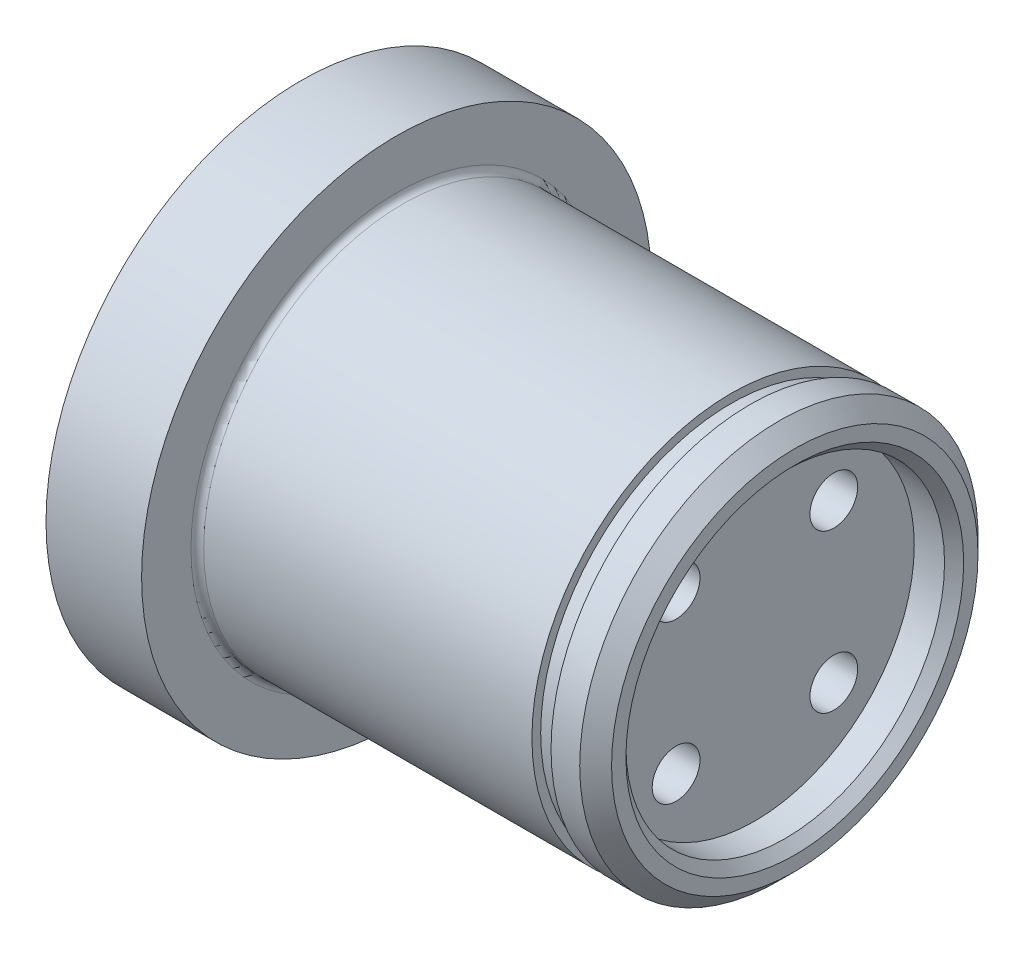
ISO-10303-21;
HEADER;
FILE_DESCRIPTION(('STEP AP214'),'2;1');
FILE_NAME('part.step','',(''),(''),'','','');
FILE_SCHEMA(('AUTOMOTIVE_DESIGN { 1 0 10303 214 1 1 1 1 }'));
ENDSEC;
DATA;
#1=APPLICATION_CONTEXT('core data for automotive mechanical design processes');
#2=APPLICATION_PROTOCOL_DEFINITION('international standard','automotive_design',2000,#1);
#3=PRODUCT_CONTEXT('',#1,'mechanical');
#4=PRODUCT('Part','Part','',(#3));
#5=PRODUCT_RELATED_PRODUCT_CATEGORY('part','',(#4));
#6=PRODUCT_DEFINITION_FORMATION('','',#4);
#7=PRODUCT_DEFINITION_CONTEXT('part definition',#1,'design');
#8=PRODUCT_DEFINITION('design','',#6,#7);
#9=PRODUCT_DEFINITION_SHAPE('','',#8);
#10=(LENGTH_UNIT() NAMED_UNIT(*) SI_UNIT(.MILLI.,.METRE.));
#11=(NAMED_UNIT(*) PLANE_ANGLE_UNIT() SI_UNIT($,.RADIAN.));
#12=(NAMED_UNIT(*) SI_UNIT($,.STERADIAN.) SOLID_ANGLE_UNIT());
#13=UNCERTAINTY_MEASURE_WITH_UNIT(LENGTH_MEASURE(1.E-05),#10,'distance_accuracy_value','');
#14=(GEOMETRIC_REPRESENTATION_CONTEXT(3) GLOBAL_UNCERTAINTY_ASSIGNED_CONTEXT((#13)) GLOBAL_UNIT_ASSIGNED_CONTEXT((#10,
#11,#12)) REPRESENTATION_CONTEXT('',''));
#15=CARTESIAN_POINT('',(0.,0.,0.));
#16=DIRECTION('',(0.,0.,1.));
#17=DIRECTION('',(1.,0.,0.));
#18=AXIS2_PLACEMENT_3D('',#15,#16,#17);
#19=CARTESIAN_POINT('',(0.,0.,0.));
#20=DIRECTION('',(-1.,0.,0.));
#21=DIRECTION('',(0.,0.,1.));
#22=AXIS2_PLACEMENT_3D('',#19,#20,#21);
#23=CYLINDRICAL_SURFACE('',#22,12.5);
#24=CARTESIAN_POINT('',(-24.6,0.,0.));
#25=DIRECTION('',(-1.,0.,0.));
#26=DIRECTION('',(0.,0.,1.));
#27=AXIS2_PLACEMENT_3D('',#24,#25,#26);
#28=CIRCLE('',#27,12.5);
#29=CARTESIAN_POINT('',(-24.6,0.,12.5));
#30=VERTEX_POINT('',#29);
#31=EDGE_CURVE('E141',#30,#30,#28,.F.);
#32=ORIENTED_EDGE('',*,*,#31,.T.);
#33=EDGE_LOOP('',(#32));
#34=FACE_BOUND('',#33,.T.);
#35=CARTESIAN_POINT('',(-4.00000000000001,0.,0.));
#36=DIRECTION('',(1.,0.,0.));
#37=DIRECTION('',(0.,0.,-1.));
#38=AXIS2_PLACEMENT_3D('',#35,#36,#37);
#39=CIRCLE('',#38,12.5);
#40=CARTESIAN_POINT('',(-4.00000000000001,0.,-12.5));
#41=VERTEX_POINT('',#40);
#42=EDGE_CURVE('E123',#41,#41,#39,.T.);
#43=ORIENTED_EDGE('',*,*,#42,.F.);
#44=EDGE_LOOP('',(#43));
#45=FACE_BOUND('',#44,.T.);
#46=ADVANCED_FACE('F35',(#34,#45),#23,.T.);
#47=CARTESIAN_POINT('',(-25.,12.5,0.));
#48=DIRECTION('',(-1.,0.,0.));
#49=DIRECTION('',(0.,0.,1.));
#50=AXIS2_PLACEMENT_3D('',#47,#48,#49);
#51=PLANE('',#50);
#52=CARTESIAN_POINT('',(-25.,0.,0.));
#53=DIRECTION('',(-1.,0.,0.));
#54=DIRECTION('',(0.,0.,1.));
#55=AXIS2_PLACEMENT_3D('',#52,#53,#54);
#56=CIRCLE('',#55,12.9);
#57=CARTESIAN_POINT('',(-25.,0.,12.9));
#58=VERTEX_POINT('',#57);
#59=EDGE_CURVE('E138',#58,#58,#56,.T.);
#60=ORIENTED_EDGE('',*,*,#59,.T.);
#61=EDGE_LOOP('',(#60));
#62=FACE_BOUND('',#61,.T.);
#63=CARTESIAN_POINT('',(-25.,0.,0.));
#64=DIRECTION('',(-1.,0.,0.));
#65=DIRECTION('',(0.,0.,1.));
#66=AXIS2_PLACEMENT_3D('',#63,#64,#65);
#67=CIRCLE('',#66,16.);
#68=CARTESIAN_POINT('',(-25.,0.,16.));
#69=VERTEX_POINT('',#68);
#70=EDGE_CURVE('E129',#69,#69,#67,.T.);
#71=ORIENTED_EDGE('',*,*,#70,.F.);
#72=EDGE_LOOP('',(#71));
#73=FACE_BOUND('',#72,.T.);
#74=ADVANCED_FACE('F166',(#62,#73),#51,.F.);
#75=CARTESIAN_POINT('',(0.,0.,0.));
#76=DIRECTION('',(-1.,0.,0.));
#77=DIRECTION('',(0.,0.,1.));
#78=AXIS2_PLACEMENT_3D('',#75,#76,#77);
#79=CYLINDRICAL_SURFACE('',#78,16.);
#80=CARTESIAN_POINT('',(-31.,0.,0.));
#81=DIRECTION('',(-1.,0.,0.));
#82=DIRECTION('',(0.,0.,1.));
#83=AXIS2_PLACEMENT_3D('',#80,#81,#82);
#84=CIRCLE('',#83,16.);
#85=CARTESIAN_POINT('',(-31.,0.,16.));
#86=VERTEX_POINT('',#85);
#87=EDGE_CURVE('E126',#86,#86,#84,.T.);
#88=ORIENTED_EDGE('',*,*,#87,.F.);
#89=EDGE_LOOP('',(#88));
#90=FACE_BOUND('',#89,.T.);
#91=ORIENTED_EDGE('',*,*,#70,.T.);
#92=EDGE_LOOP('',(#91));
#93=FACE_BOUND('',#92,.T.);
#94=ADVANCED_FACE('F173',(#90,#93),#79,.T.);
#95=CARTESIAN_POINT('',(-31.,16.,0.));
#96=DIRECTION('',(1.,0.,0.));
#97=DIRECTION('',(0.,0.,-1.));
#98=AXIS2_PLACEMENT_3D('',#95,#96,#97);
#99=PLANE('',#98);
#100=CARTESIAN_POINT('',(-31.,10.,-1.05969086964441E-13));
#101=DIRECTION('',(-1.,0.,0.));
#102=DIRECTION('',(0.,0.,1.));
#103=AXIS2_PLACEMENT_3D('',#100,#101,#102);
#104=CIRCLE('',#103,1.575);
#105=CARTESIAN_POINT('',(-31.,10.,1.57499999999989));
#106=VERTEX_POINT('',#105);
#107=EDGE_CURVE('E67',#106,#106,#104,.T.);
#108=ORIENTED_EDGE('',*,*,#107,.F.);
#109=EDGE_LOOP('',(#108));
#110=FACE_BOUND('',#109,.T.);
#111=CARTESIAN_POINT('',(-31.,0.,10.));
#112=DIRECTION('',(-1.,0.,0.));
#113=DIRECTION('',(0.,0.,1.));
#114=AXIS2_PLACEMENT_3D('',#111,#112,#113);
#115=CIRCLE('',#114,1.575);
#116=CARTESIAN_POINT('',(-31.,0.,11.575));
#117=VERTEX_POINT('',#116);
#118=EDGE_CURVE('E66',#117,#117,#115,.T.);
#119=ORIENTED_EDGE('',*,*,#118,.F.);
#120=EDGE_LOOP('',(#119));
#121=FACE_BOUND('',#120,.T.);
#122=CARTESIAN_POINT('',(-31.,-10.,0.));
#123=DIRECTION('',(-1.,0.,0.));
#124=DIRECTION('',(0.,0.,1.));
#125=AXIS2_PLACEMENT_3D('',#122,#123,#124);
#126=CIRCLE('',#125,1.575);
#127=CARTESIAN_POINT('',(-31.,-10.,1.57500000000004));
#128=VERTEX_POINT('',#127);
#129=EDGE_CURVE('E77',#128,#128,#126,.T.);
#130=ORIENTED_EDGE('',*,*,#129,.F.);
#131=EDGE_LOOP('',(#130));
#132=FACE_BOUND('',#131,.T.);
#133=CARTESIAN_POINT('',(-31.,0.,-10.));
#134=DIRECTION('',(-1.,0.,0.));
#135=DIRECTION('',(0.,0.,1.));
#136=AXIS2_PLACEMENT_3D('',#133,#134,#135);
#137=CIRCLE('',#136,1.575);
#138=CARTESIAN_POINT('',(-31.,0.,-8.425));
#139=VERTEX_POINT('',#138);
#140=EDGE_CURVE('E83',#139,#139,#137,.T.);
#141=ORIENTED_EDGE('',*,*,#140,.F.);
#142=EDGE_LOOP('',(#141));
#143=FACE_BOUND('',#142,.T.);
#144=ORIENTED_EDGE('',*,*,#87,.T.);
#145=EDGE_LOOP('',(#144));
#146=FACE_BOUND('',#145,.T.);
#147=ADVANCED_FACE('F209',(#110,#121,#132,#143,#146),#99,.F.);
#148=CARTESIAN_POINT('',(-4.00000000000001,12.5,0.));
#149=DIRECTION('',(-1.,0.,0.));
#150=DIRECTION('',(0.,0.,1.));
#151=AXIS2_PLACEMENT_3D('',#148,#149,#150);
#152=PLANE('',#151);
#153=CARTESIAN_POINT('',(-4.00000000000001,0.,0.));
#154=DIRECTION('',(1.,0.,0.));
#155=DIRECTION('',(0.,0.,-1.));
#156=AXIS2_PLACEMENT_3D('',#153,#154,#155);
#157=CIRCLE('',#156,11.95);
#158=CARTESIAN_POINT('',(-4.00000000000001,0.,-11.95));
#159=VERTEX_POINT('',#158);
#160=EDGE_CURVE('E120',#159,#159,#157,.T.);
#161=ORIENTED_EDGE('',*,*,#160,.F.);
#162=EDGE_LOOP('',(#161));
#163=FACE_BOUND('',#162,.T.);
#164=ORIENTED_EDGE('',*,*,#42,.T.);
#165=EDGE_LOOP('',(#164));
#166=FACE_BOUND('',#165,.T.);
#167=ADVANCED_FACE('F203',(#163,#166),#152,.F.);
#168=CARTESIAN_POINT('',(0.,0.,0.));
#169=DIRECTION('',(1.,0.,0.));
#170=DIRECTION('',(0.,0.,-1.));
#171=AXIS2_PLACEMENT_3D('',#168,#169,#170);
#172=CYLINDRICAL_SURFACE('',#171,11.95);
#173=CARTESIAN_POINT('',(-2.80000000000001,0.,0.));
#174=DIRECTION('',(1.,0.,0.));
#175=DIRECTION('',(0.,0.,-1.));
#176=AXIS2_PLACEMENT_3D('',#173,#174,#175);
#177=CIRCLE('',#176,11.95);
#178=CARTESIAN_POINT('',(-2.80000000000001,0.,-11.95));
#179=VERTEX_POINT('',#178);
#180=EDGE_CURVE('E117',#179,#179,#177,.T.);
#181=ORIENTED_EDGE('',*,*,#180,.F.);
#182=EDGE_LOOP('',(#181));
#183=FACE_BOUND('',#182,.T.);
#184=ORIENTED_EDGE('',*,*,#160,.T.);
#185=EDGE_LOOP('',(#184));
#186=FACE_BOUND('',#185,.T.);
#187=ADVANCED_FACE('F197',(#183,#186),#172,.T.);
#188=CARTESIAN_POINT('',(-2.80000000000001,11.95,0.));
#189=DIRECTION('',(1.,0.,0.));
#190=DIRECTION('',(0.,0.,-1.));
#191=AXIS2_PLACEMENT_3D('',#188,#189,#190);
#192=PLANE('',#191);
#193=CARTESIAN_POINT('',(-2.80000000000001,0.,0.));
#194=DIRECTION('',(1.,0.,0.));
#195=DIRECTION('',(0.,0.,-1.));
#196=AXIS2_PLACEMENT_3D('',#193,#194,#195);
#197=CIRCLE('',#196,12.5);
#198=CARTESIAN_POINT('',(-2.80000000000001,0.,-12.5));
#199=VERTEX_POINT('',#198);
#200=EDGE_CURVE('E114',#199,#199,#197,.T.);
#201=ORIENTED_EDGE('',*,*,#200,.F.);
#202=EDGE_LOOP('',(#201));
#203=FACE_BOUND('',#202,.T.);
#204=ORIENTED_EDGE('',*,*,#180,.T.);
#205=EDGE_LOOP('',(#204));
#206=FACE_BOUND('',#205,.T.);
#207=ADVANCED_FACE('F189',(#203,#206),#192,.F.);
#208=CARTESIAN_POINT('',(0.,0.,0.));
#209=DIRECTION('',(-1.,0.,0.));
#210=DIRECTION('',(0.,0.,1.));
#211=AXIS2_PLACEMENT_3D('',#208,#209,#210);
#212=PLANE('',#211);
#213=CARTESIAN_POINT('',(0.,0.,0.));
#214=DIRECTION('',(-1.,0.,0.));
#215=DIRECTION('',(0.,0.,1.));
#216=AXIS2_PLACEMENT_3D('',#213,#214,#215);
#217=CIRCLE('',#216,10.6);
#218=CARTESIAN_POINT('',(0.,0.,10.6));
#219=VERTEX_POINT('',#218);
#220=EDGE_CURVE('E11',#219,#219,#217,.T.);
#221=ORIENTED_EDGE('',*,*,#220,.T.);
#222=EDGE_LOOP('',(#221));
#223=FACE_BOUND('',#222,.T.);
#224=CARTESIAN_POINT('',(0.,0.,0.));
#225=DIRECTION('',(-1.,0.,0.));
#226=DIRECTION('',(0.,0.,1.));
#227=AXIS2_PLACEMENT_3D('',#224,#225,#226);
#228=CIRCLE('',#227,11.5);
#229=CARTESIAN_POINT('',(0.,0.,11.5));
#230=VERTEX_POINT('',#229);
#231=EDGE_CURVE('E135',#230,#230,#228,.F.);
#232=ORIENTED_EDGE('',*,*,#231,.T.);
#233=EDGE_LOOP('',(#232));
#234=FACE_BOUND('',#233,.T.);
#235=ADVANCED_FACE('F180',(#223,#234),#212,.F.);
#236=CARTESIAN_POINT('',(-0.999999999999996,0.,0.));
#237=DIRECTION('',(-1.,0.,0.));
#238=DIRECTION('',(0.,0.,1.));
#239=AXIS2_PLACEMENT_3D('',#236,#237,#238);
#240=CIRCLE('',#239,12.5);
#241=CARTESIAN_POINT('',(-0.999999999999996,0.,12.5));
#242=VERTEX_POINT('',#241);
#243=EDGE_CURVE('E132',#242,#242,#240,.T.);
#244=ORIENTED_EDGE('',*,*,#243,.T.);
#245=EDGE_LOOP('',(#244));
#246=FACE_BOUND('',#245,.T.);
#247=ORIENTED_EDGE('',*,*,#200,.T.);
#248=EDGE_LOOP('',(#247));
#249=FACE_BOUND('',#248,.T.);
#250=ADVANCED_FACE('F169',(#246,#249),#23,.T.);
#251=CARTESIAN_POINT('',(-0.999999999999996,0.,0.));
#252=DIRECTION('',(-1.,0.,0.));
#253=DIRECTION('',(0.,0.,1.));
#254=AXIS2_PLACEMENT_3D('',#251,#252,#253);
#255=CONICAL_SURFACE('',#254,12.5,0.785398163397451);
#256=ORIENTED_EDGE('',*,*,#231,.F.);
#257=EDGE_LOOP('',(#256));
#258=FACE_BOUND('',#257,.T.);
#259=ORIENTED_EDGE('',*,*,#243,.F.);
#260=EDGE_LOOP('',(#259));
#261=FACE_BOUND('',#260,.T.);
#262=ADVANCED_FACE('F179',(#258,#261),#255,.T.);
#263=CARTESIAN_POINT('',(-24.6,0.,0.));
#264=DIRECTION('',(-1.,0.,0.));
#265=DIRECTION('',(0.,0.,1.));
#266=AXIS2_PLACEMENT_3D('',#263,#264,#265);
#267=TOROIDAL_SURFACE('',#266,12.9,0.4);
#268=ORIENTED_EDGE('',*,*,#31,.F.);
#269=EDGE_LOOP('',(#268));
#270=FACE_BOUND('',#269,.T.);
#271=ORIENTED_EDGE('',*,*,#59,.F.);
#272=EDGE_LOOP('',(#271));
#273=FACE_BOUND('',#272,.T.);
#274=ADVANCED_FACE('F186',(#270,#273),#267,.F.);
#275=CARTESIAN_POINT('',(-2.5,10.,0.));
#276=DIRECTION('',(-1.,0.,0.));
#277=DIRECTION('',(0.,0.,1.));
#278=AXIS2_PLACEMENT_3D('',#275,#276,#277);
#279=PLANE('',#278);
#280=CARTESIAN_POINT('',(-2.5,-4.94974746830585,-4.94974746830581));
#281=DIRECTION('',(-1.,0.,0.));
#282=DIRECTION('',(0.,0.,1.));
#283=AXIS2_PLACEMENT_3D('',#280,#281,#282);
#284=CIRCLE('',#283,1.50000000000001);
#285=CARTESIAN_POINT('',(-2.5,-4.94974746830585,-3.4497474683058));
#286=VERTEX_POINT('',#285);
#287=EDGE_CURVE('E96',#286,#286,#284,.F.);
#288=ORIENTED_EDGE('',*,*,#287,.F.);
#289=EDGE_LOOP('',(#288));
#290=FACE_BOUND('',#289,.T.);
#291=CARTESIAN_POINT('',(-2.5,4.94974746830588,4.94974746830578));
#292=DIRECTION('',(-1.,0.,0.));
#293=DIRECTION('',(0.,0.,1.));
#294=AXIS2_PLACEMENT_3D('',#291,#292,#293);
#295=CIRCLE('',#294,1.50000000000001);
#296=CARTESIAN_POINT('',(-2.5,4.94974746830588,6.44974746830579));
#297=VERTEX_POINT('',#296);
#298=EDGE_CURVE('E92',#297,#297,#295,.F.);
#299=ORIENTED_EDGE('',*,*,#298,.F.);
#300=EDGE_LOOP('',(#299));
#301=FACE_BOUND('',#300,.T.);
#302=CARTESIAN_POINT('',(-2.5,0.,0.));
#303=DIRECTION('',(1.,0.,0.));
#304=DIRECTION('',(0.,0.,-1.));
#305=AXIS2_PLACEMENT_3D('',#302,#303,#304);
#306=CIRCLE('',#305,10.);
#307=CARTESIAN_POINT('',(-2.5,0.,-10.));
#308=VERTEX_POINT('',#307);
#309=EDGE_CURVE('E89',#308,#308,#306,.T.);
#310=ORIENTED_EDGE('',*,*,#309,.T.);
#311=EDGE_LOOP('',(#310));
#312=FACE_BOUND('',#311,.T.);
#313=CARTESIAN_POINT('',(-2.5,-4.94974746830583,4.94974746830583));
#314=DIRECTION('',(-1.,0.,0.));
#315=DIRECTION('',(0.,0.,1.));
#316=AXIS2_PLACEMENT_3D('',#313,#314,#315);
#317=CIRCLE('',#316,1.50000000000001);
#318=CARTESIAN_POINT('',(-2.5,-4.94974746830583,6.44974746830585));
#319=VERTEX_POINT('',#318);
#320=EDGE_CURVE('E93',#319,#319,#317,.F.);
#321=ORIENTED_EDGE('',*,*,#320,.F.);
#322=EDGE_LOOP('',(#321));
#323=FACE_BOUND('',#322,.T.);
#324=CARTESIAN_POINT('',(-2.5,4.94974746830583,-4.94974746830583));
#325=DIRECTION('',(-1.,0.,0.));
#326=DIRECTION('',(0.,0.,1.));
#327=AXIS2_PLACEMENT_3D('',#324,#325,#326);
#328=CIRCLE('',#327,1.50000000000001);
#329=CARTESIAN_POINT('',(-2.5,4.94974746830583,-3.44974746830582));
#330=VERTEX_POINT('',#329);
#331=EDGE_CURVE('E99',#330,#330,#328,.F.);
#332=ORIENTED_EDGE('',*,*,#331,.F.);
#333=EDGE_LOOP('',(#332));
#334=FACE_BOUND('',#333,.T.);
#335=ADVANCED_FACE('F299',(#290,#301,#312,#323,#334),#279,.F.);
#336=CARTESIAN_POINT('',(0.,0.,0.));
#337=DIRECTION('',(1.,0.,0.));
#338=DIRECTION('',(0.,0.,-1.));
#339=AXIS2_PLACEMENT_3D('',#336,#337,#338);
#340=CYLINDRICAL_SURFACE('',#339,10.);
#341=CARTESIAN_POINT('',(-0.599999999999998,0.,0.));
#342=DIRECTION('',(-1.,0.,0.));
#343=DIRECTION('',(0.,0.,1.));
#344=AXIS2_PLACEMENT_3D('',#341,#342,#343);
#345=CIRCLE('',#344,10.);
#346=CARTESIAN_POINT('',(-0.599999999999998,0.,10.));
#347=VERTEX_POINT('',#346);
#348=EDGE_CURVE('E43',#347,#347,#345,.F.);
#349=ORIENTED_EDGE('',*,*,#348,.T.);
#350=EDGE_LOOP('',(#349));
#351=FACE_BOUND('',#350,.T.);
#352=ORIENTED_EDGE('',*,*,#309,.F.);
#353=EDGE_LOOP('',(#352));
#354=FACE_BOUND('',#353,.T.);
#355=ADVANCED_FACE('F148',(#351,#354),#340,.F.);
#356=CARTESIAN_POINT('',(-15.,-4.94974746830583,4.94974746830583));
#357=DIRECTION('',(-1.,0.,0.));
#358=DIRECTION('',(0.,0.,1.));
#359=AXIS2_PLACEMENT_3D('',#356,#357,#358);
#360=PLANE('',#359);
#361=CARTESIAN_POINT('',(-15.,-4.94974746830583,4.94974746830583));
#362=DIRECTION('',(1.,0.,0.));
#363=DIRECTION('',(0.,0.,-1.));
#364=AXIS2_PLACEMENT_3D('',#361,#362,#363);
#365=CIRCLE('',#364,1.50000000000001);
#366=CARTESIAN_POINT('',(-15.,-4.94974746830583,3.44974746830582));
#367=VERTEX_POINT('',#366);
#368=EDGE_CURVE('E105',#367,#367,#365,.T.);
#369=ORIENTED_EDGE('',*,*,#368,.T.);
#370=EDGE_LOOP('',(#369));
#371=FACE_BOUND('',#370,.T.);
#372=ADVANCED_FACE('F304',(#371),#360,.F.);
#373=CARTESIAN_POINT('',(0.,-4.94974746830583,4.94974746830583));
#374=DIRECTION('',(1.,0.,0.));
#375=DIRECTION('',(0.,0.,-1.));
#376=AXIS2_PLACEMENT_3D('',#373,#374,#375);
#377=CYLINDRICAL_SURFACE('',#376,1.50000000000001);
#378=ORIENTED_EDGE('',*,*,#320,.T.);
#379=EDGE_LOOP('',(#378));
#380=FACE_BOUND('',#379,.T.);
#381=ORIENTED_EDGE('',*,*,#368,.F.);
#382=EDGE_LOOP('',(#381));
#383=FACE_BOUND('',#382,.T.);
#384=ADVANCED_FACE('F310',(#380,#383),#377,.F.);
#385=CARTESIAN_POINT('',(-15.,-4.94974746830585,-4.94974746830581));
#386=DIRECTION('',(-1.,0.,0.));
#387=DIRECTION('',(0.,0.,1.));
#388=AXIS2_PLACEMENT_3D('',#385,#386,#387);
#389=PLANE('',#388);
#390=CARTESIAN_POINT('',(-15.,-4.94974746830585,-4.94974746830581));
#391=DIRECTION('',(1.,0.,0.));
#392=DIRECTION('',(0.,0.,-1.));
#393=AXIS2_PLACEMENT_3D('',#390,#391,#392);
#394=CIRCLE('',#393,1.50000000000001);
#395=CARTESIAN_POINT('',(-15.,-4.94974746830585,-6.44974746830583));
#396=VERTEX_POINT('',#395);
#397=EDGE_CURVE('E108',#396,#396,#394,.T.);
#398=ORIENTED_EDGE('',*,*,#397,.T.);
#399=EDGE_LOOP('',(#398));
#400=FACE_BOUND('',#399,.T.);
#401=ADVANCED_FACE('F313',(#400),#389,.F.);
#402=CARTESIAN_POINT('',(0.,-4.94974746830585,-4.94974746830581));
#403=DIRECTION('',(1.,0.,0.));
#404=DIRECTION('',(0.,0.,-1.));
#405=AXIS2_PLACEMENT_3D('',#402,#403,#404);
#406=CYLINDRICAL_SURFACE('',#405,1.50000000000001);
#407=ORIENTED_EDGE('',*,*,#287,.T.);
#408=EDGE_LOOP('',(#407));
#409=FACE_BOUND('',#408,.T.);
#410=ORIENTED_EDGE('',*,*,#397,.F.);
#411=EDGE_LOOP('',(#410));
#412=FACE_BOUND('',#411,.T.);
#413=ADVANCED_FACE('F318',(#409,#412),#406,.F.);
#414=CARTESIAN_POINT('',(-15.,4.94974746830583,-4.94974746830583));
#415=DIRECTION('',(-1.,0.,0.));
#416=DIRECTION('',(0.,0.,1.));
#417=AXIS2_PLACEMENT_3D('',#414,#415,#416);
#418=PLANE('',#417);
#419=CARTESIAN_POINT('',(-15.,4.94974746830583,-4.94974746830583));
#420=DIRECTION('',(1.,0.,0.));
#421=DIRECTION('',(0.,0.,-1.));
#422=AXIS2_PLACEMENT_3D('',#419,#420,#421);
#423=CIRCLE('',#422,1.50000000000001);
#424=CARTESIAN_POINT('',(-15.,4.94974746830583,-6.44974746830584));
#425=VERTEX_POINT('',#424);
#426=EDGE_CURVE('E111',#425,#425,#423,.T.);
#427=ORIENTED_EDGE('',*,*,#426,.T.);
#428=EDGE_LOOP('',(#427));
#429=FACE_BOUND('',#428,.T.);
#430=ADVANCED_FACE('F321',(#429),#418,.F.);
#431=CARTESIAN_POINT('',(0.,4.94974746830583,-4.94974746830583));
#432=DIRECTION('',(1.,0.,0.));
#433=DIRECTION('',(0.,0.,-1.));
#434=AXIS2_PLACEMENT_3D('',#431,#432,#433);
#435=CYLINDRICAL_SURFACE('',#434,1.50000000000001);
#436=ORIENTED_EDGE('',*,*,#331,.T.);
#437=EDGE_LOOP('',(#436));
#438=FACE_BOUND('',#437,.T.);
#439=ORIENTED_EDGE('',*,*,#426,.F.);
#440=EDGE_LOOP('',(#439));
#441=FACE_BOUND('',#440,.T.);
#442=ADVANCED_FACE('F308',(#438,#441),#435,.F.);
#443=CARTESIAN_POINT('',(-15.,4.94974746830588,4.94974746830578));
#444=DIRECTION('',(-1.,0.,0.));
#445=DIRECTION('',(0.,0.,1.));
#446=AXIS2_PLACEMENT_3D('',#443,#444,#445);
#447=PLANE('',#446);
#448=CARTESIAN_POINT('',(-15.,4.94974746830588,4.94974746830578));
#449=DIRECTION('',(1.,0.,0.));
#450=DIRECTION('',(0.,0.,-1.));
#451=AXIS2_PLACEMENT_3D('',#448,#449,#450);
#452=CIRCLE('',#451,1.50000000000001);
#453=CARTESIAN_POINT('',(-15.,4.94974746830588,3.44974746830577));
#454=VERTEX_POINT('',#453);
#455=EDGE_CURVE('E102',#454,#454,#452,.T.);
#456=ORIENTED_EDGE('',*,*,#455,.T.);
#457=EDGE_LOOP('',(#456));
#458=FACE_BOUND('',#457,.T.);
#459=ADVANCED_FACE('F161',(#458),#447,.F.);
#460=CARTESIAN_POINT('',(0.,4.94974746830588,4.94974746830578));
#461=DIRECTION('',(1.,0.,0.));
#462=DIRECTION('',(0.,0.,-1.));
#463=AXIS2_PLACEMENT_3D('',#460,#461,#462);
#464=CYLINDRICAL_SURFACE('',#463,1.50000000000001);
#465=ORIENTED_EDGE('',*,*,#298,.T.);
#466=EDGE_LOOP('',(#465));
#467=FACE_BOUND('',#466,.T.);
#468=ORIENTED_EDGE('',*,*,#455,.F.);
#469=EDGE_LOOP('',(#468));
#470=FACE_BOUND('',#469,.T.);
#471=ADVANCED_FACE('F153',(#467,#470),#464,.F.);
#472=CARTESIAN_POINT('',(-0.599999999999998,0.,0.));
#473=DIRECTION('',(1.,0.,0.));
#474=DIRECTION('',(0.,0.,-1.));
#475=AXIS2_PLACEMENT_3D('',#472,#473,#474);
#476=CONICAL_SURFACE('',#475,10.,0.785398163397448);
#477=ORIENTED_EDGE('',*,*,#220,.F.);
#478=EDGE_LOOP('',(#477));
#479=FACE_BOUND('',#478,.T.);
#480=ORIENTED_EDGE('',*,*,#348,.F.);
#481=EDGE_LOOP('',(#480));
#482=FACE_BOUND('',#481,.T.);
#483=ADVANCED_FACE('F37',(#479,#482),#476,.F.);
#484=CARTESIAN_POINT('',(-11.,0.,-10.));
#485=DIRECTION('',(-1.,0.,0.));
#486=DIRECTION('',(0.,0.,1.));
#487=AXIS2_PLACEMENT_3D('',#484,#485,#486);
#488=CONICAL_SURFACE('',#487,1.575,1.02974425867665);
#489=CARTESIAN_POINT('',(-10.0536445250316,0.,-10.));
#490=VERTEX_POINT('',#489);
#491=VERTEX_LOOP('',#490);
#492=FACE_BOUND('',#491,.T.);
#493=CARTESIAN_POINT('',(-11.,0.,-10.));
#494=DIRECTION('',(-1.,0.,0.));
#495=DIRECTION('',(0.,0.,1.));
#496=AXIS2_PLACEMENT_3D('',#493,#494,#495);
#497=CIRCLE('',#496,1.575);
#498=CARTESIAN_POINT('',(-11.,0.,-8.42500000000001));
#499=VERTEX_POINT('',#498);
#500=EDGE_CURVE('E86',#499,#499,#497,.T.);
#501=ORIENTED_EDGE('',*,*,#500,.T.);
#502=EDGE_LOOP('',(#501));
#503=FACE_BOUND('',#502,.T.);
#504=ADVANCED_FACE('F152',(#492,#503),#488,.F.);
#505=CARTESIAN_POINT('',(-31.,0.,-10.));
#506=DIRECTION('',(-1.,0.,0.));
#507=DIRECTION('',(0.,0.,1.));
#508=AXIS2_PLACEMENT_3D('',#505,#506,#507);
#509=CYLINDRICAL_SURFACE('',#508,1.575);
#510=ORIENTED_EDGE('',*,*,#500,.F.);
#511=EDGE_LOOP('',(#510));
#512=FACE_BOUND('',#511,.T.);
#513=ORIENTED_EDGE('',*,*,#140,.T.);
#514=EDGE_LOOP('',(#513));
#515=FACE_BOUND('',#514,.T.);
#516=ADVANCED_FACE('F159',(#512,#515),#509,.F.);
#517=CARTESIAN_POINT('',(-11.,-10.,0.));
#518=DIRECTION('',(-1.,0.,0.));
#519=DIRECTION('',(0.,0.,1.));
#520=AXIS2_PLACEMENT_3D('',#517,#518,#519);
#521=CONICAL_SURFACE('',#520,1.57499999999999,1.02974425867665);
#522=CARTESIAN_POINT('',(-10.0536445250316,-10.,0.));
#523=VERTEX_POINT('',#522);
#524=VERTEX_LOOP('',#523);
#525=FACE_BOUND('',#524,.T.);
#526=CARTESIAN_POINT('',(-11.,-10.,0.));
#527=DIRECTION('',(-1.,0.,0.));
#528=DIRECTION('',(0.,0.,1.));
#529=AXIS2_PLACEMENT_3D('',#526,#527,#528);
#530=CIRCLE('',#529,1.57499999999999);
#531=CARTESIAN_POINT('',(-11.,-10.,1.57500000000003));
#532=VERTEX_POINT('',#531);
#533=EDGE_CURVE('E80',#532,#532,#530,.T.);
#534=ORIENTED_EDGE('',*,*,#533,.T.);
#535=EDGE_LOOP('',(#534));
#536=FACE_BOUND('',#535,.T.);
#537=ADVANCED_FACE('F244',(#525,#536),#521,.F.);
#538=CARTESIAN_POINT('',(-31.,-10.,0.));
#539=DIRECTION('',(-1.,0.,0.));
#540=DIRECTION('',(0.,0.,1.));
#541=AXIS2_PLACEMENT_3D('',#538,#539,#540);
#542=CYLINDRICAL_SURFACE('',#541,1.575);
#543=ORIENTED_EDGE('',*,*,#533,.F.);
#544=EDGE_LOOP('',(#543));
#545=FACE_BOUND('',#544,.T.);
#546=ORIENTED_EDGE('',*,*,#129,.T.);
#547=EDGE_LOOP('',(#546));
#548=FACE_BOUND('',#547,.T.);
#549=ADVANCED_FACE('F249',(#545,#548),#542,.F.);
#550=CARTESIAN_POINT('',(-11.,0.,10.));
#551=DIRECTION('',(-1.,0.,0.));
#552=DIRECTION('',(0.,0.,1.));
#553=AXIS2_PLACEMENT_3D('',#550,#551,#552);
#554=CONICAL_SURFACE('',#553,1.575,1.02974425867665);
#555=CARTESIAN_POINT('',(-10.0536445250316,0.,10.));
#556=VERTEX_POINT('',#555);
#557=VERTEX_LOOP('',#556);
#558=FACE_BOUND('',#557,.T.);
#559=CARTESIAN_POINT('',(-11.,0.,10.));
#560=DIRECTION('',(-1.,0.,0.));
#561=DIRECTION('',(0.,0.,1.));
#562=AXIS2_PLACEMENT_3D('',#559,#560,#561);
#563=CIRCLE('',#562,1.575);
#564=CARTESIAN_POINT('',(-11.,0.,11.575));
#565=VERTEX_POINT('',#564);
#566=EDGE_CURVE('E70',#565,#565,#563,.T.);
#567=ORIENTED_EDGE('',*,*,#566,.T.);
#568=EDGE_LOOP('',(#567));
#569=FACE_BOUND('',#568,.T.);
#570=ADVANCED_FACE('F258',(#558,#569),#554,.F.);
#571=CARTESIAN_POINT('',(-31.,0.,10.));
#572=DIRECTION('',(-1.,0.,0.));
#573=DIRECTION('',(0.,0.,1.));
#574=AXIS2_PLACEMENT_3D('',#571,#572,#573);
#575=CYLINDRICAL_SURFACE('',#574,1.575);
#576=ORIENTED_EDGE('',*,*,#566,.F.);
#577=EDGE_LOOP('',(#576));
#578=FACE_BOUND('',#577,.T.);
#579=ORIENTED_EDGE('',*,*,#118,.T.);
#580=EDGE_LOOP('',(#579));
#581=FACE_BOUND('',#580,.T.);
#582=ADVANCED_FACE('F60',(#578,#581),#575,.F.);
#583=CARTESIAN_POINT('',(-11.,10.,-1.05969086964441E-13));
#584=DIRECTION('',(-1.,0.,0.));
#585=DIRECTION('',(0.,0.,1.));
#586=AXIS2_PLACEMENT_3D('',#583,#584,#585);
#587=CONICAL_SURFACE('',#586,1.57499999999999,1.02974425867665);
#588=CARTESIAN_POINT('',(-10.0536445250316,9.99999999999999,-1.05969086964441E-13));
#589=VERTEX_POINT('',#588);
#590=VERTEX_LOOP('',#589);
#591=FACE_BOUND('',#590,.T.);
#592=CARTESIAN_POINT('',(-11.,10.,-1.05969086964441E-13));
#593=DIRECTION('',(-1.,0.,0.));
#594=DIRECTION('',(0.,0.,1.));
#595=AXIS2_PLACEMENT_3D('',#592,#593,#594);
#596=CIRCLE('',#595,1.57499999999999);
#597=CARTESIAN_POINT('',(-11.,10.,1.57499999999989));
#598=VERTEX_POINT('',#597);
#599=EDGE_CURVE('E64',#598,#598,#596,.T.);
#600=ORIENTED_EDGE('',*,*,#599,.T.);
#601=EDGE_LOOP('',(#600));
#602=FACE_BOUND('',#601,.T.);
#603=ADVANCED_FACE('F56',(#591,#602),#587,.F.);
#604=CARTESIAN_POINT('',(-31.,10.,-1.05969086964441E-13));
#605=DIRECTION('',(-1.,0.,0.));
#606=DIRECTION('',(0.,0.,1.));
#607=AXIS2_PLACEMENT_3D('',#604,#605,#606);
#608=CYLINDRICAL_SURFACE('',#607,1.575);
#609=ORIENTED_EDGE('',*,*,#599,.F.);
#610=EDGE_LOOP('',(#609));
#611=FACE_BOUND('',#610,.T.);
#612=ORIENTED_EDGE('',*,*,#107,.T.);
#613=EDGE_LOOP('',(#612));
#614=FACE_BOUND('',#613,.T.);
#615=ADVANCED_FACE('F59',(#611,#614),#608,.F.);
#616=CLOSED_SHELL('',(#46,#74,#94,#147,#167,#187,#207,#235,#250,#262,#274,#335,#355,#372,#384,
#401,#413,#430,#442,#459,#471,#483,#504,#516,#537,#549,#570,#582,#603,#615));
#617=MANIFOLD_SOLID_BREP('B2',#616);
#618=ADVANCED_BREP_SHAPE_REPRESENTATION('',(#18,#617),#14);
#619=SHAPE_DEFINITION_REPRESENTATION(#9,#618);
ENDSEC;
END-ISO-10303-21;
